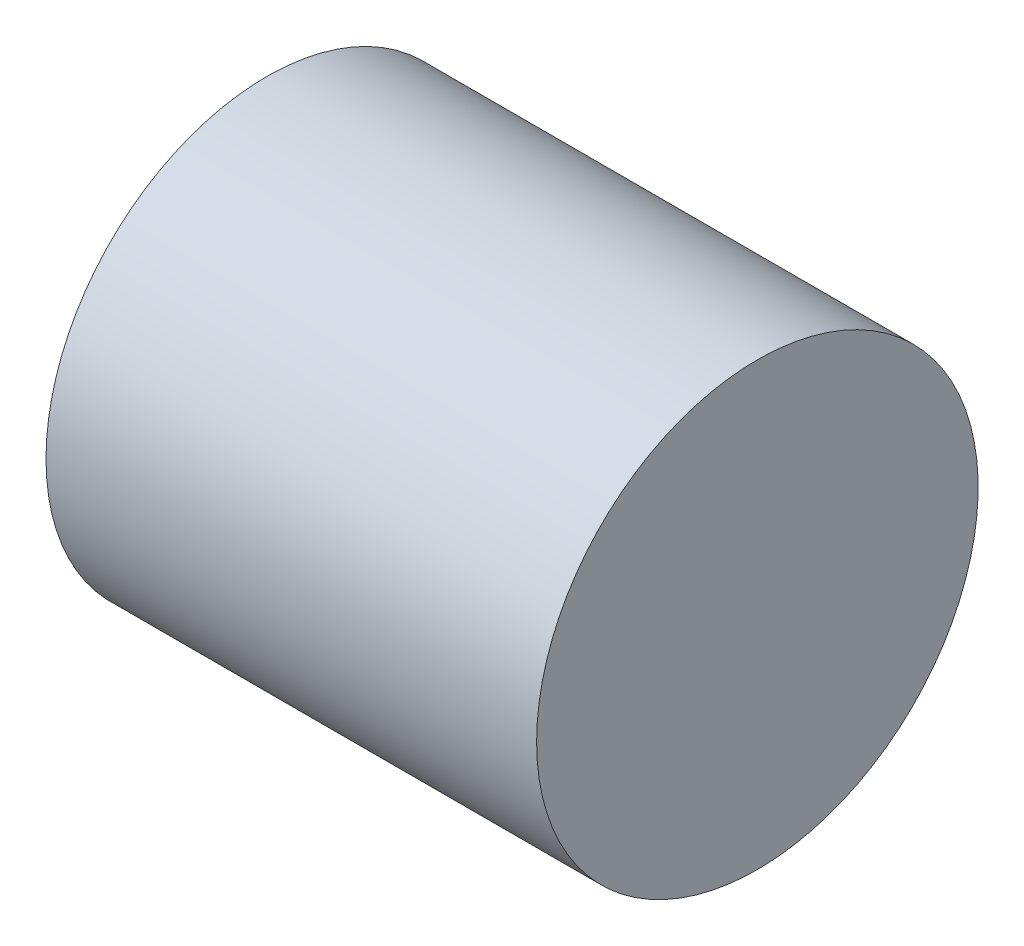
ISO-10303-21;
HEADER;
FILE_DESCRIPTION(('STEP AP214'),'2;1');
FILE_NAME('part.step','',(''),(''),'','','');
FILE_SCHEMA(('AUTOMOTIVE_DESIGN { 1 0 10303 214 1 1 1 1 }'));
ENDSEC;
DATA;
#1=APPLICATION_CONTEXT('core data for automotive mechanical design processes');
#2=APPLICATION_PROTOCOL_DEFINITION('international standard','automotive_design',2000,#1);
#3=PRODUCT_CONTEXT('',#1,'mechanical');
#4=PRODUCT('Part','Part','',(#3));
#5=PRODUCT_RELATED_PRODUCT_CATEGORY('part','',(#4));
#6=PRODUCT_DEFINITION_FORMATION('','',#4);
#7=PRODUCT_DEFINITION_CONTEXT('part definition',#1,'design');
#8=PRODUCT_DEFINITION('design','',#6,#7);
#9=PRODUCT_DEFINITION_SHAPE('','',#8);
#10=(LENGTH_UNIT() NAMED_UNIT(*) SI_UNIT(.MILLI.,.METRE.));
#11=(NAMED_UNIT(*) PLANE_ANGLE_UNIT() SI_UNIT($,.RADIAN.));
#12=(NAMED_UNIT(*) SI_UNIT($,.STERADIAN.) SOLID_ANGLE_UNIT());
#13=UNCERTAINTY_MEASURE_WITH_UNIT(LENGTH_MEASURE(1.E-05),#10,'distance_accuracy_value','');
#14=(GEOMETRIC_REPRESENTATION_CONTEXT(3) GLOBAL_UNCERTAINTY_ASSIGNED_CONTEXT((#13)) GLOBAL_UNIT_ASSIGNED_CONTEXT((#10,
#11,#12)) REPRESENTATION_CONTEXT('',''));
#15=CARTESIAN_POINT('',(0.,0.,0.));
#16=DIRECTION('',(0.,0.,1.));
#17=DIRECTION('',(1.,0.,0.));
#18=AXIS2_PLACEMENT_3D('',#15,#16,#17);
#19=CARTESIAN_POINT('',(0.,0.,0.));
#20=DIRECTION('',(-1.,0.,0.));
#21=DIRECTION('',(0.,0.,1.));
#22=AXIS2_PLACEMENT_3D('',#19,#20,#21);
#23=PLANE('',#22);
#24=CARTESIAN_POINT('',(0.,18.,0.));
#25=DIRECTION('',(-1.,0.,0.));
#26=DIRECTION('',(0.,0.,1.));
#27=AXIS2_PLACEMENT_3D('',#24,#25,#26);
#28=CIRCLE('',#27,18.);
#29=CARTESIAN_POINT('',(0.,18.,18.));
#30=VERTEX_POINT('',#29);
#31=EDGE_CURVE('E46',#30,#30,#28,.T.);
#32=ORIENTED_EDGE('',*,*,#31,.T.);
#33=EDGE_LOOP('',(#32));
#34=FACE_BOUND('',#33,.T.);
#35=ADVANCED_FACE('F39',(#34),#23,.T.);
#36=CARTESIAN_POINT('',(40.,0.,0.));
#37=DIRECTION('',(1.,0.,0.));
#38=DIRECTION('',(0.,0.,-1.));
#39=AXIS2_PLACEMENT_3D('',#36,#37,#38);
#40=PLANE('',#39);
#41=CARTESIAN_POINT('',(40.,18.,0.));
#42=DIRECTION('',(-1.,0.,0.));
#43=DIRECTION('',(0.,0.,1.));
#44=AXIS2_PLACEMENT_3D('',#41,#42,#43);
#45=CIRCLE('',#44,18.);
#46=CARTESIAN_POINT('',(40.,18.,18.));
#47=VERTEX_POINT('',#46);
#48=EDGE_CURVE('E10',#47,#47,#45,.T.);
#49=ORIENTED_EDGE('',*,*,#48,.F.);
#50=EDGE_LOOP('',(#49));
#51=FACE_BOUND('',#50,.T.);
#52=ADVANCED_FACE('F56',(#51),#40,.T.);
#53=CARTESIAN_POINT('',(0.,18.,0.));
#54=DIRECTION('',(-1.,0.,0.));
#55=DIRECTION('',(0.,0.,1.));
#56=AXIS2_PLACEMENT_3D('',#53,#54,#55);
#57=CYLINDRICAL_SURFACE('',#56,18.);
#58=ORIENTED_EDGE('',*,*,#48,.T.);
#59=EDGE_LOOP('',(#58));
#60=FACE_BOUND('',#59,.T.);
#61=ORIENTED_EDGE('',*,*,#31,.F.);
#62=EDGE_LOOP('',(#61));
#63=FACE_BOUND('',#62,.T.);
#64=ADVANCED_FACE('F54',(#60,#63),#57,.T.);
#65=CLOSED_SHELL('',(#35,#52,#64));
#66=MANIFOLD_SOLID_BREP('B2',#65);
#67=ADVANCED_BREP_SHAPE_REPRESENTATION('',(#18,#66),#14);
#68=SHAPE_DEFINITION_REPRESENTATION(#9,#67);
ENDSEC;
END-ISO-10303-21;
